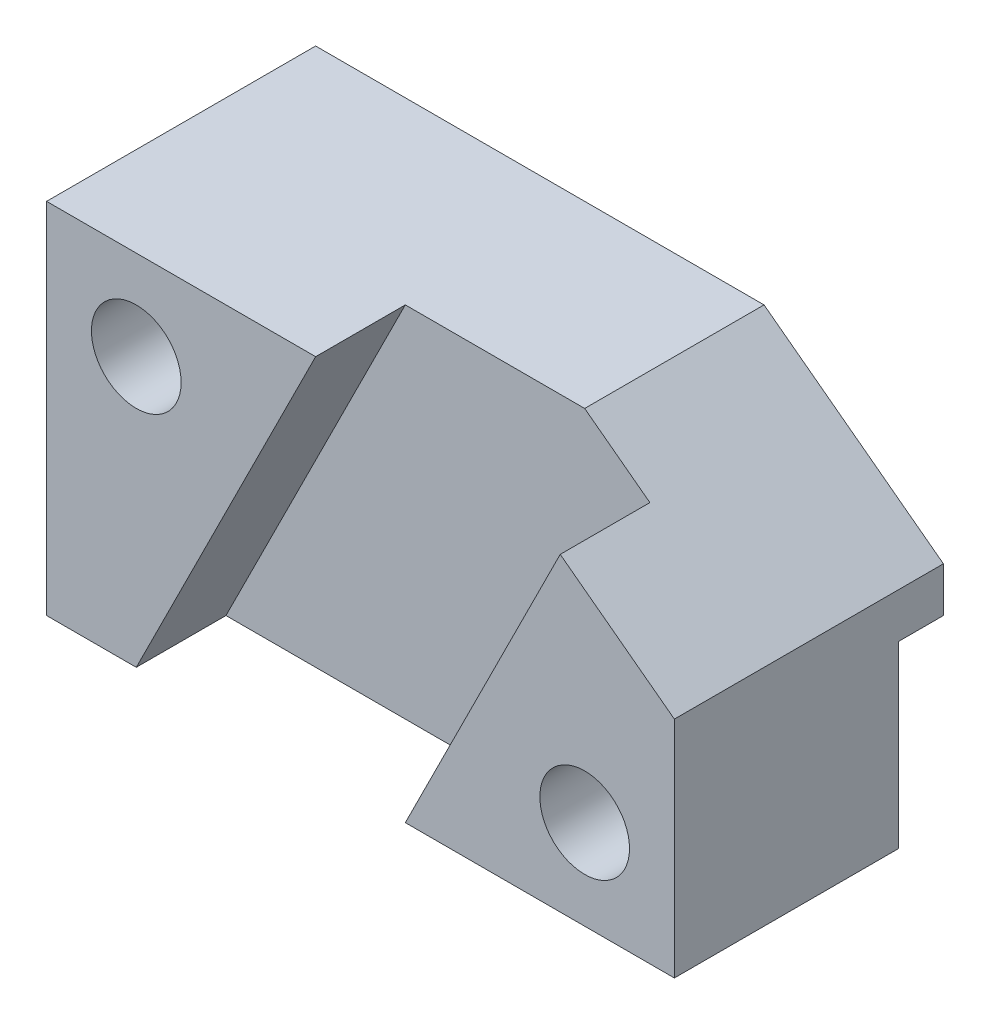
ISO-10303-21;
HEADER;
FILE_DESCRIPTION(('STEP AP214'),'2;1');
FILE_NAME('part.step','',(''),(''),'','','');
FILE_SCHEMA(('AUTOMOTIVE_DESIGN { 1 0 10303 214 1 1 1 1 }'));
ENDSEC;
DATA;
#1=APPLICATION_CONTEXT('core data for automotive mechanical design processes');
#2=APPLICATION_PROTOCOL_DEFINITION('international standard','automotive_design',2000,#1);
#3=PRODUCT_CONTEXT('',#1,'mechanical');
#4=PRODUCT('Part','Part','',(#3));
#5=PRODUCT_RELATED_PRODUCT_CATEGORY('part','',(#4));
#6=PRODUCT_DEFINITION_FORMATION('','',#4);
#7=PRODUCT_DEFINITION_CONTEXT('part definition',#1,'design');
#8=PRODUCT_DEFINITION('design','',#6,#7);
#9=PRODUCT_DEFINITION_SHAPE('','',#8);
#10=(LENGTH_UNIT() NAMED_UNIT(*) SI_UNIT(.MILLI.,.METRE.));
#11=(NAMED_UNIT(*) PLANE_ANGLE_UNIT() SI_UNIT($,.RADIAN.));
#12=(NAMED_UNIT(*) SI_UNIT($,.STERADIAN.) SOLID_ANGLE_UNIT());
#13=UNCERTAINTY_MEASURE_WITH_UNIT(LENGTH_MEASURE(1.E-05),#10,'distance_accuracy_value','');
#14=(GEOMETRIC_REPRESENTATION_CONTEXT(3) GLOBAL_UNCERTAINTY_ASSIGNED_CONTEXT((#13)) GLOBAL_UNIT_ASSIGNED_CONTEXT((#10,
#11,#12)) REPRESENTATION_CONTEXT('',''));
#15=CARTESIAN_POINT('',(0.,0.,0.));
#16=DIRECTION('',(0.,0.,1.));
#17=DIRECTION('',(1.,0.,0.));
#18=AXIS2_PLACEMENT_3D('',#15,#16,#17);
#19=CARTESIAN_POINT('',(0.,40.,0.));
#20=DIRECTION('',(0.,0.,-1.));
#21=DIRECTION('',(-1.,0.,0.));
#22=AXIS2_PLACEMENT_3D('',#19,#20,#21);
#23=PLANE('',#22);
#24=CARTESIAN_POINT('',(60.,9.99999999999999,0.));
#25=DIRECTION('',(0.,0.,1.));
#26=DIRECTION('',(1.,0.,0.));
#27=AXIS2_PLACEMENT_3D('',#24,#25,#26);
#28=CIRCLE('',#27,5.);
#29=CARTESIAN_POINT('',(65.,9.99999999999999,0.));
#30=VERTEX_POINT('',#29);
#31=EDGE_CURVE('E252',#30,#30,#28,.T.);
#32=ORIENTED_EDGE('',*,*,#31,.F.);
#33=EDGE_LOOP('',(#32));
#34=FACE_BOUND('',#33,.T.);
#35=DIRECTION('',(0.,-1.,0.));
#36=VECTOR('',#35,1.);
#37=CARTESIAN_POINT('',(70.,40.,0.));
#38=LINE('',#37,#36);
#39=CARTESIAN_POINT('',(70.,25.,0.));
#40=VERTEX_POINT('',#39);
#41=CARTESIAN_POINT('',(70.,0.,0.));
#42=VERTEX_POINT('',#41);
#43=EDGE_CURVE('E156',#40,#42,#38,.T.);
#44=ORIENTED_EDGE('',*,*,#43,.F.);
#45=DIRECTION('',(-0.8,0.6,0.));
#46=VECTOR('',#45,1.);
#47=CARTESIAN_POINT('',(70.,25.,0.));
#48=LINE('',#47,#46);
#49=CARTESIAN_POINT('',(57.2727272727273,34.5454545454545,0.));
#50=VERTEX_POINT('',#49);
#51=EDGE_CURVE('E234',#40,#50,#48,.T.);
#52=ORIENTED_EDGE('',*,*,#51,.T.);
#53=DIRECTION('',(0.447213595499958,0.894427190999916,0.));
#54=VECTOR('',#53,1.);
#55=CARTESIAN_POINT('',(40.,0.,0.));
#56=LINE('',#55,#54);
#57=CARTESIAN_POINT('',(40.,0.,0.));
#58=VERTEX_POINT('',#57);
#59=EDGE_CURVE('E205',#58,#50,#56,.T.);
#60=ORIENTED_EDGE('',*,*,#59,.F.);
#61=DIRECTION('',(1.,0.,0.));
#62=VECTOR('',#61,1.);
#63=CARTESIAN_POINT('',(0.,0.,0.));
#64=LINE('',#63,#62);
#65=EDGE_CURVE('E179',#58,#42,#64,.T.);
#66=ORIENTED_EDGE('',*,*,#65,.T.);
#67=EDGE_LOOP('',(#44,#52,#60,#66));
#68=FACE_BOUND('',#67,.T.);
#69=ADVANCED_FACE('F39',(#34,#68),#23,.F.);
#70=CARTESIAN_POINT('',(0.,40.,0.));
#71=DIRECTION('',(1.,0.,0.));
#72=DIRECTION('',(0.,0.,-1.));
#73=AXIS2_PLACEMENT_3D('',#70,#71,#72);
#74=PLANE('',#73);
#75=DIRECTION('',(0.,0.,1.));
#76=VECTOR('',#75,1.);
#77=CARTESIAN_POINT('',(0.,20.,-30.));
#78=LINE('',#77,#76);
#79=CARTESIAN_POINT('',(0.,20.,-30.));
#80=VERTEX_POINT('',#79);
#81=CARTESIAN_POINT('',(0.,20.,-25.));
#82=VERTEX_POINT('',#81);
#83=EDGE_CURVE('E122',#80,#82,#78,.T.);
#84=ORIENTED_EDGE('',*,*,#83,.T.);
#85=DIRECTION('',(0.,-1.,0.));
#86=VECTOR('',#85,1.);
#87=CARTESIAN_POINT('',(0.,0.,-25.));
#88=LINE('',#87,#86);
#89=CARTESIAN_POINT('',(0.,0.,-25.));
#90=VERTEX_POINT('',#89);
#91=EDGE_CURVE('E134',#82,#90,#88,.T.);
#92=ORIENTED_EDGE('',*,*,#91,.T.);
#93=DIRECTION('',(0.,0.,1.));
#94=VECTOR('',#93,1.);
#95=CARTESIAN_POINT('',(0.,0.,0.));
#96=LINE('',#95,#94);
#97=CARTESIAN_POINT('',(0.,0.,0.));
#98=VERTEX_POINT('',#97);
#99=EDGE_CURVE('E176',#90,#98,#96,.T.);
#100=ORIENTED_EDGE('',*,*,#99,.T.);
#101=DIRECTION('',(0.,-1.,0.));
#102=VECTOR('',#101,1.);
#103=CARTESIAN_POINT('',(0.,40.,0.));
#104=LINE('',#103,#102);
#105=CARTESIAN_POINT('',(0.,40.,0.));
#106=VERTEX_POINT('',#105);
#107=EDGE_CURVE('E49',#106,#98,#104,.T.);
#108=ORIENTED_EDGE('',*,*,#107,.F.);
#109=DIRECTION('',(0.,0.,1.));
#110=VECTOR('',#109,1.);
#111=CARTESIAN_POINT('',(0.,40.,0.));
#112=LINE('',#111,#110);
#113=CARTESIAN_POINT('',(0.,40.,-30.));
#114=VERTEX_POINT('',#113);
#115=EDGE_CURVE('E150',#114,#106,#112,.T.);
#116=ORIENTED_EDGE('',*,*,#115,.F.);
#117=DIRECTION('',(0.,-1.,0.));
#118=VECTOR('',#117,1.);
#119=CARTESIAN_POINT('',(0.,40.,-30.));
#120=LINE('',#119,#118);
#121=EDGE_CURVE('E141',#114,#80,#120,.T.);
#122=ORIENTED_EDGE('',*,*,#121,.T.);
#123=EDGE_LOOP('',(#84,#92,#100,#108,#116,#122));
#124=FACE_BOUND('',#123,.T.);
#125=ADVANCED_FACE('F41',(#124),#74,.F.);
#126=CARTESIAN_POINT('',(10.,30.,0.));
#127=DIRECTION('',(0.,0.,1.));
#128=DIRECTION('',(1.,0.,0.));
#129=AXIS2_PLACEMENT_3D('',#126,#127,#128);
#130=CIRCLE('',#129,5.);
#131=CARTESIAN_POINT('',(15.,30.,0.));
#132=VERTEX_POINT('',#131);
#133=EDGE_CURVE('E257',#132,#132,#130,.T.);
#134=ORIENTED_EDGE('',*,*,#133,.F.);
#135=EDGE_LOOP('',(#134));
#136=FACE_BOUND('',#135,.T.);
#137=CARTESIAN_POINT('',(10.,0.,0.));
#138=VERTEX_POINT('',#137);
#139=EDGE_CURVE('E173',#98,#138,#64,.T.);
#140=ORIENTED_EDGE('',*,*,#139,.T.);
#141=DIRECTION('',(-0.447213595499958,-0.894427190999916,0.));
#142=VECTOR('',#141,1.);
#143=CARTESIAN_POINT('',(30.,40.,0.));
#144=LINE('',#143,#142);
#145=CARTESIAN_POINT('',(30.,40.,0.));
#146=VERTEX_POINT('',#145);
#147=EDGE_CURVE('E210',#146,#138,#144,.T.);
#148=ORIENTED_EDGE('',*,*,#147,.F.);
#149=DIRECTION('',(1.,0.,0.));
#150=VECTOR('',#149,1.);
#151=CARTESIAN_POINT('',(0.,40.,0.));
#152=LINE('',#151,#150);
#153=EDGE_CURVE('E158',#106,#146,#152,.T.);
#154=ORIENTED_EDGE('',*,*,#153,.F.);
#155=ORIENTED_EDGE('',*,*,#107,.T.);
#156=EDGE_LOOP('',(#140,#148,#154,#155));
#157=FACE_BOUND('',#156,.T.);
#158=ADVANCED_FACE('F170',(#136,#157),#23,.F.);
#159=CARTESIAN_POINT('',(70.,40.,0.));
#160=DIRECTION('',(-1.,0.,0.));
#161=DIRECTION('',(0.,0.,1.));
#162=AXIS2_PLACEMENT_3D('',#159,#160,#161);
#163=PLANE('',#162);
#164=DIRECTION('',(0.,0.,-1.));
#165=VECTOR('',#164,1.);
#166=CARTESIAN_POINT('',(70.,0.,0.));
#167=LINE('',#166,#165);
#168=CARTESIAN_POINT('',(70.,0.,-25.));
#169=VERTEX_POINT('',#168);
#170=EDGE_CURVE('E161',#42,#169,#167,.T.);
#171=ORIENTED_EDGE('',*,*,#170,.T.);
#172=DIRECTION('',(0.,-1.,0.));
#173=VECTOR('',#172,1.);
#174=CARTESIAN_POINT('',(70.,0.,-25.));
#175=LINE('',#174,#173);
#176=CARTESIAN_POINT('',(70.,20.,-25.));
#177=VERTEX_POINT('',#176);
#178=EDGE_CURVE('E56',#177,#169,#175,.T.);
#179=ORIENTED_EDGE('',*,*,#178,.F.);
#180=DIRECTION('',(0.,0.,1.));
#181=VECTOR('',#180,1.);
#182=CARTESIAN_POINT('',(70.,20.,-30.));
#183=LINE('',#182,#181);
#184=CARTESIAN_POINT('',(70.,20.,-30.));
#185=VERTEX_POINT('',#184);
#186=EDGE_CURVE('E247',#185,#177,#183,.T.);
#187=ORIENTED_EDGE('',*,*,#186,.F.);
#188=DIRECTION('',(0.,-1.,0.));
#189=VECTOR('',#188,1.);
#190=CARTESIAN_POINT('',(70.,40.,-30.));
#191=LINE('',#190,#189);
#192=CARTESIAN_POINT('',(70.,25.,-30.));
#193=VERTEX_POINT('',#192);
#194=EDGE_CURVE('E145',#193,#185,#191,.T.);
#195=ORIENTED_EDGE('',*,*,#194,.F.);
#196=DIRECTION('',(0.,0.,-1.));
#197=VECTOR('',#196,1.);
#198=CARTESIAN_POINT('',(70.,25.,0.));
#199=LINE('',#198,#197);
#200=EDGE_CURVE('E231',#40,#193,#199,.T.);
#201=ORIENTED_EDGE('',*,*,#200,.F.);
#202=ORIENTED_EDGE('',*,*,#43,.T.);
#203=EDGE_LOOP('',(#171,#179,#187,#195,#201,#202));
#204=FACE_BOUND('',#203,.T.);
#205=ADVANCED_FACE('F274',(#204),#163,.F.);
#206=CARTESIAN_POINT('',(0.,40.,-30.));
#207=DIRECTION('',(0.,0.,1.));
#208=DIRECTION('',(1.,0.,0.));
#209=AXIS2_PLACEMENT_3D('',#206,#207,#208);
#210=PLANE('',#209);
#211=CARTESIAN_POINT('',(10.,30.,-30.));
#212=DIRECTION('',(0.,0.,1.));
#213=DIRECTION('',(1.,0.,0.));
#214=AXIS2_PLACEMENT_3D('',#211,#212,#213);
#215=CIRCLE('',#214,5.);
#216=CARTESIAN_POINT('',(15.,30.,-30.));
#217=VERTEX_POINT('',#216);
#218=EDGE_CURVE('E256',#217,#217,#215,.T.);
#219=ORIENTED_EDGE('',*,*,#218,.T.);
#220=EDGE_LOOP('',(#219));
#221=FACE_BOUND('',#220,.T.);
#222=ORIENTED_EDGE('',*,*,#194,.T.);
#223=DIRECTION('',(1.,0.,0.));
#224=VECTOR('',#223,1.);
#225=CARTESIAN_POINT('',(0.,20.,-30.));
#226=LINE('',#225,#224);
#227=EDGE_CURVE('E126',#80,#185,#226,.T.);
#228=ORIENTED_EDGE('',*,*,#227,.F.);
#229=ORIENTED_EDGE('',*,*,#121,.F.);
#230=DIRECTION('',(-1.,0.,0.));
#231=VECTOR('',#230,1.);
#232=CARTESIAN_POINT('',(0.,40.,-30.));
#233=LINE('',#232,#231);
#234=CARTESIAN_POINT('',(50.,40.,-30.));
#235=VERTEX_POINT('',#234);
#236=EDGE_CURVE('E152',#235,#114,#233,.T.);
#237=ORIENTED_EDGE('',*,*,#236,.F.);
#238=DIRECTION('',(0.8,-0.6,0.));
#239=VECTOR('',#238,1.);
#240=CARTESIAN_POINT('',(18.,64.,-30.));
#241=LINE('',#240,#239);
#242=EDGE_CURVE('E213',#235,#193,#241,.T.);
#243=ORIENTED_EDGE('',*,*,#242,.T.);
#244=EDGE_LOOP('',(#222,#228,#229,#237,#243));
#245=FACE_BOUND('',#244,.T.);
#246=ADVANCED_FACE('F139',(#221,#245),#210,.F.);
#247=CARTESIAN_POINT('',(0.,40.,0.));
#248=DIRECTION('',(0.,-1.,0.));
#249=DIRECTION('',(0.,0.,-1.));
#250=AXIS2_PLACEMENT_3D('',#247,#248,#249);
#251=PLANE('',#250);
#252=DIRECTION('',(-1.,0.,0.));
#253=VECTOR('',#252,1.);
#254=CARTESIAN_POINT('',(60.,40.,-10.));
#255=LINE('',#254,#253);
#256=CARTESIAN_POINT('',(50.,40.,-10.));
#257=VERTEX_POINT('',#256);
#258=CARTESIAN_POINT('',(30.,40.,-10.));
#259=VERTEX_POINT('',#258);
#260=EDGE_CURVE('E209',#257,#259,#255,.T.);
#261=ORIENTED_EDGE('',*,*,#260,.F.);
#262=DIRECTION('',(0.,0.,-1.));
#263=VECTOR('',#262,1.);
#264=CARTESIAN_POINT('',(50.,40.,0.));
#265=LINE('',#264,#263);
#266=EDGE_CURVE('E63',#257,#235,#265,.T.);
#267=ORIENTED_EDGE('',*,*,#266,.T.);
#268=ORIENTED_EDGE('',*,*,#236,.T.);
#269=ORIENTED_EDGE('',*,*,#115,.T.);
#270=ORIENTED_EDGE('',*,*,#153,.T.);
#271=DIRECTION('',(0.,0.,1.));
#272=VECTOR('',#271,1.);
#273=CARTESIAN_POINT('',(30.,40.,-10.));
#274=LINE('',#273,#272);
#275=EDGE_CURVE('E197',#259,#146,#274,.T.);
#276=ORIENTED_EDGE('',*,*,#275,.F.);
#277=EDGE_LOOP('',(#261,#267,#268,#269,#270,#276));
#278=FACE_BOUND('',#277,.T.);
#279=ADVANCED_FACE('F295',(#278),#251,.F.);
#280=CARTESIAN_POINT('',(0.,0.,0.));
#281=DIRECTION('',(0.,-1.,0.));
#282=DIRECTION('',(0.,0.,-1.));
#283=AXIS2_PLACEMENT_3D('',#280,#281,#282);
#284=PLANE('',#283);
#285=DIRECTION('',(1.,0.,0.));
#286=VECTOR('',#285,1.);
#287=CARTESIAN_POINT('',(0.,0.,-25.));
#288=LINE('',#287,#286);
#289=EDGE_CURVE('E239',#90,#169,#288,.T.);
#290=ORIENTED_EDGE('',*,*,#289,.T.);
#291=ORIENTED_EDGE('',*,*,#170,.F.);
#292=ORIENTED_EDGE('',*,*,#65,.F.);
#293=DIRECTION('',(0.,0.,1.));
#294=VECTOR('',#293,1.);
#295=CARTESIAN_POINT('',(40.,0.,-10.));
#296=LINE('',#295,#294);
#297=CARTESIAN_POINT('',(40.,0.,-10.));
#298=VERTEX_POINT('',#297);
#299=EDGE_CURVE('E180',#298,#58,#296,.T.);
#300=ORIENTED_EDGE('',*,*,#299,.F.);
#301=DIRECTION('',(1.,0.,0.));
#302=VECTOR('',#301,1.);
#303=CARTESIAN_POINT('',(10.,0.,-10.));
#304=LINE('',#303,#302);
#305=CARTESIAN_POINT('',(10.,0.,-10.));
#306=VERTEX_POINT('',#305);
#307=EDGE_CURVE('E217',#306,#298,#304,.T.);
#308=ORIENTED_EDGE('',*,*,#307,.F.);
#309=DIRECTION('',(0.,0.,1.));
#310=VECTOR('',#309,1.);
#311=CARTESIAN_POINT('',(10.,0.,-10.));
#312=LINE('',#311,#310);
#313=EDGE_CURVE('E186',#306,#138,#312,.T.);
#314=ORIENTED_EDGE('',*,*,#313,.T.);
#315=ORIENTED_EDGE('',*,*,#139,.F.);
#316=ORIENTED_EDGE('',*,*,#99,.F.);
#317=EDGE_LOOP('',(#290,#291,#292,#300,#308,#314,#315,#316));
#318=FACE_BOUND('',#317,.T.);
#319=ADVANCED_FACE('F183',(#318),#284,.T.);
#320=CARTESIAN_POINT('',(40.,0.,-10.));
#321=DIRECTION('',(0.894427190999916,-0.447213595499958,0.));
#322=DIRECTION('',(0.447213595499958,0.894427190999916,0.));
#323=AXIS2_PLACEMENT_3D('',#320,#321,#322);
#324=PLANE('',#323);
#325=ORIENTED_EDGE('',*,*,#59,.T.);
#326=DIRECTION('',(0.,0.,-1.));
#327=VECTOR('',#326,1.);
#328=CARTESIAN_POINT('',(57.2727272727273,34.5454545454545,-10.));
#329=LINE('',#328,#327);
#330=CARTESIAN_POINT('',(57.2727272727273,34.5454545454545,-10.));
#331=VERTEX_POINT('',#330);
#332=EDGE_CURVE('E227',#50,#331,#329,.T.);
#333=ORIENTED_EDGE('',*,*,#332,.T.);
#334=DIRECTION('',(0.447213595499958,0.894427190999916,0.));
#335=VECTOR('',#334,1.);
#336=CARTESIAN_POINT('',(40.,0.,-10.));
#337=LINE('',#336,#335);
#338=EDGE_CURVE('E200',#298,#331,#337,.T.);
#339=ORIENTED_EDGE('',*,*,#338,.F.);
#340=ORIENTED_EDGE('',*,*,#299,.T.);
#341=EDGE_LOOP('',(#325,#333,#339,#340));
#342=FACE_BOUND('',#341,.T.);
#343=ADVANCED_FACE('F305',(#342),#324,.F.);
#344=CARTESIAN_POINT('',(30.,40.,-10.));
#345=DIRECTION('',(-0.894427190999916,0.447213595499958,0.));
#346=DIRECTION('',(-0.447213595499958,-0.894427190999916,0.));
#347=AXIS2_PLACEMENT_3D('',#344,#345,#346);
#348=PLANE('',#347);
#349=ORIENTED_EDGE('',*,*,#147,.T.);
#350=ORIENTED_EDGE('',*,*,#313,.F.);
#351=DIRECTION('',(-0.447213595499958,-0.894427190999916,0.));
#352=VECTOR('',#351,1.);
#353=CARTESIAN_POINT('',(30.,40.,-10.));
#354=LINE('',#353,#352);
#355=EDGE_CURVE('E220',#259,#306,#354,.T.);
#356=ORIENTED_EDGE('',*,*,#355,.F.);
#357=ORIENTED_EDGE('',*,*,#275,.T.);
#358=EDGE_LOOP('',(#349,#350,#356,#357));
#359=FACE_BOUND('',#358,.T.);
#360=ADVANCED_FACE('F301',(#359),#348,.F.);
#361=CARTESIAN_POINT('',(0.,0.,-10.));
#362=DIRECTION('',(0.,0.,1.));
#363=DIRECTION('',(1.,0.,0.));
#364=AXIS2_PLACEMENT_3D('',#361,#362,#363);
#365=PLANE('',#364);
#366=DIRECTION('',(0.8,-0.6,0.));
#367=VECTOR('',#366,1.);
#368=CARTESIAN_POINT('',(37.2,49.6,-10.));
#369=LINE('',#368,#367);
#370=EDGE_CURVE('E11',#257,#331,#369,.T.);
#371=ORIENTED_EDGE('',*,*,#370,.F.);
#372=ORIENTED_EDGE('',*,*,#260,.T.);
#373=ORIENTED_EDGE('',*,*,#355,.T.);
#374=ORIENTED_EDGE('',*,*,#307,.T.);
#375=ORIENTED_EDGE('',*,*,#338,.T.);
#376=EDGE_LOOP('',(#371,#372,#373,#374,#375));
#377=FACE_BOUND('',#376,.T.);
#378=ADVANCED_FACE('F299',(#377),#365,.T.);
#379=CARTESIAN_POINT('',(70.,25.,0.));
#380=DIRECTION('',(-0.6,-0.8,0.));
#381=DIRECTION('',(0.8,-0.6,0.));
#382=AXIS2_PLACEMENT_3D('',#379,#380,#381);
#383=PLANE('',#382);
#384=ORIENTED_EDGE('',*,*,#266,.F.);
#385=ORIENTED_EDGE('',*,*,#370,.T.);
#386=ORIENTED_EDGE('',*,*,#332,.F.);
#387=ORIENTED_EDGE('',*,*,#51,.F.);
#388=ORIENTED_EDGE('',*,*,#200,.T.);
#389=ORIENTED_EDGE('',*,*,#242,.F.);
#390=EDGE_LOOP('',(#384,#385,#386,#387,#388,#389));
#391=FACE_BOUND('',#390,.T.);
#392=ADVANCED_FACE('F292',(#391),#383,.F.);
#393=CARTESIAN_POINT('',(0.,0.,-25.));
#394=DIRECTION('',(0.,0.,1.));
#395=DIRECTION('',(1.,0.,0.));
#396=AXIS2_PLACEMENT_3D('',#393,#394,#395);
#397=PLANE('',#396);
#398=CARTESIAN_POINT('',(60.,9.99999999999999,-25.));
#399=DIRECTION('',(0.,0.,1.));
#400=DIRECTION('',(1.,0.,0.));
#401=AXIS2_PLACEMENT_3D('',#398,#399,#400);
#402=CIRCLE('',#401,5.);
#403=CARTESIAN_POINT('',(65.,9.99999999999999,-25.));
#404=VERTEX_POINT('',#403);
#405=EDGE_CURVE('E43',#404,#404,#402,.T.);
#406=ORIENTED_EDGE('',*,*,#405,.T.);
#407=EDGE_LOOP('',(#406));
#408=FACE_BOUND('',#407,.T.);
#409=ORIENTED_EDGE('',*,*,#178,.T.);
#410=ORIENTED_EDGE('',*,*,#289,.F.);
#411=ORIENTED_EDGE('',*,*,#91,.F.);
#412=DIRECTION('',(1.,0.,0.));
#413=VECTOR('',#412,1.);
#414=CARTESIAN_POINT('',(0.,20.,-25.));
#415=LINE('',#414,#413);
#416=EDGE_CURVE('E128',#82,#177,#415,.T.);
#417=ORIENTED_EDGE('',*,*,#416,.T.);
#418=EDGE_LOOP('',(#409,#410,#411,#417));
#419=FACE_BOUND('',#418,.T.);
#420=ADVANCED_FACE('F306',(#408,#419),#397,.F.);
#421=CARTESIAN_POINT('',(0.,20.,-30.));
#422=DIRECTION('',(0.,1.,0.));
#423=DIRECTION('',(0.,0.,1.));
#424=AXIS2_PLACEMENT_3D('',#421,#422,#423);
#425=PLANE('',#424);
#426=ORIENTED_EDGE('',*,*,#186,.T.);
#427=ORIENTED_EDGE('',*,*,#416,.F.);
#428=ORIENTED_EDGE('',*,*,#83,.F.);
#429=ORIENTED_EDGE('',*,*,#227,.T.);
#430=EDGE_LOOP('',(#426,#427,#428,#429));
#431=FACE_BOUND('',#430,.T.);
#432=ADVANCED_FACE('F125',(#431),#425,.F.);
#433=CARTESIAN_POINT('',(60.,9.99999999999999,-30.));
#434=DIRECTION('',(0.,0.,1.));
#435=DIRECTION('',(1.,0.,0.));
#436=AXIS2_PLACEMENT_3D('',#433,#434,#435);
#437=CYLINDRICAL_SURFACE('',#436,5.);
#438=ORIENTED_EDGE('',*,*,#31,.T.);
#439=EDGE_LOOP('',(#438));
#440=FACE_BOUND('',#439,.T.);
#441=ORIENTED_EDGE('',*,*,#405,.F.);
#442=EDGE_LOOP('',(#441));
#443=FACE_BOUND('',#442,.T.);
#444=ADVANCED_FACE('F269',(#440,#443),#437,.F.);
#445=CARTESIAN_POINT('',(10.,30.,-30.));
#446=DIRECTION('',(0.,0.,1.));
#447=DIRECTION('',(1.,0.,0.));
#448=AXIS2_PLACEMENT_3D('',#445,#446,#447);
#449=CYLINDRICAL_SURFACE('',#448,5.);
#450=ORIENTED_EDGE('',*,*,#218,.F.);
#451=EDGE_LOOP('',(#450));
#452=FACE_BOUND('',#451,.T.);
#453=ORIENTED_EDGE('',*,*,#133,.T.);
#454=EDGE_LOOP('',(#453));
#455=FACE_BOUND('',#454,.T.);
#456=ADVANCED_FACE('F266',(#452,#455),#449,.F.);
#457=CLOSED_SHELL('',(#69,#125,#158,#205,#246,#279,#319,#343,#360,#378,#392,#420,#432,#444,#456));
#458=MANIFOLD_SOLID_BREP('B2',#457);
#459=ADVANCED_BREP_SHAPE_REPRESENTATION('',(#18,#458),#14);
#460=SHAPE_DEFINITION_REPRESENTATION(#9,#459);
ENDSEC;
END-ISO-10303-21;
